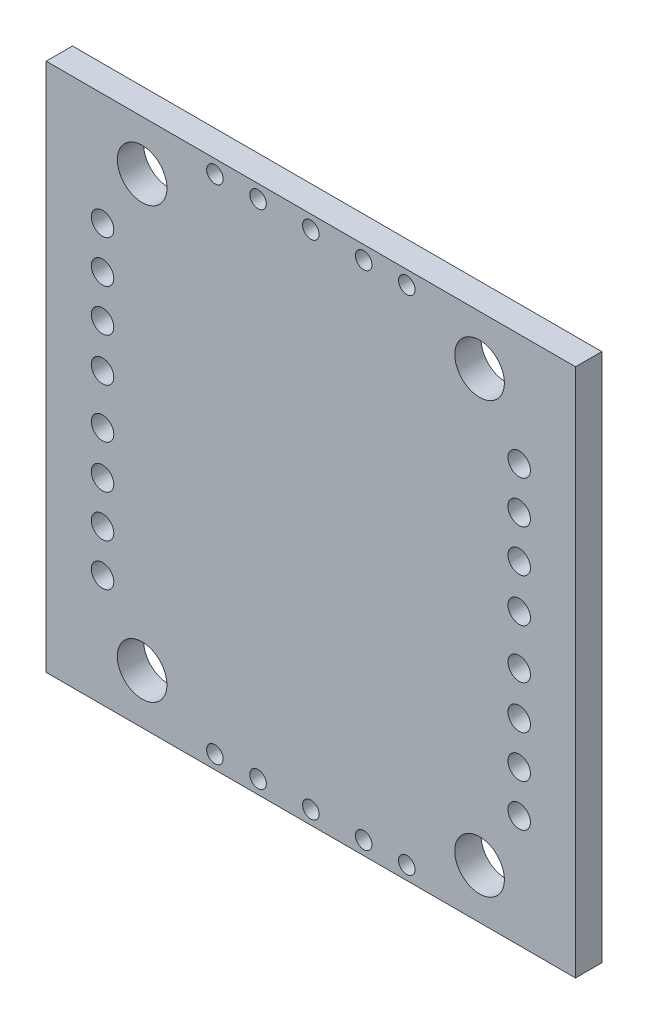
ISO-10303-21;
HEADER;
FILE_DESCRIPTION(('STEP AP214'),'2;1');
FILE_NAME('part.step','',(''),(''),'','','');
FILE_SCHEMA(('AUTOMOTIVE_DESIGN { 1 0 10303 214 1 1 1 1 }'));
ENDSEC;
DATA;
#1=APPLICATION_CONTEXT('core data for automotive mechanical design processes');
#2=APPLICATION_PROTOCOL_DEFINITION('international standard','automotive_design',2000,#1);
#3=PRODUCT_CONTEXT('',#1,'mechanical');
#4=PRODUCT('Part','Part','',(#3));
#5=PRODUCT_RELATED_PRODUCT_CATEGORY('part','',(#4));
#6=PRODUCT_DEFINITION_FORMATION('','',#4);
#7=PRODUCT_DEFINITION_CONTEXT('part definition',#1,'design');
#8=PRODUCT_DEFINITION('design','',#6,#7);
#9=PRODUCT_DEFINITION_SHAPE('','',#8);
#10=(LENGTH_UNIT() NAMED_UNIT(*) SI_UNIT(.MILLI.,.METRE.));
#11=(NAMED_UNIT(*) PLANE_ANGLE_UNIT() SI_UNIT($,.RADIAN.));
#12=(NAMED_UNIT(*) SI_UNIT($,.STERADIAN.) SOLID_ANGLE_UNIT());
#13=UNCERTAINTY_MEASURE_WITH_UNIT(LENGTH_MEASURE(1.E-05),#10,'distance_accuracy_value','');
#14=(GEOMETRIC_REPRESENTATION_CONTEXT(3) GLOBAL_UNCERTAINTY_ASSIGNED_CONTEXT((#13)) GLOBAL_UNIT_ASSIGNED_CONTEXT((#10,
#11,#12)) REPRESENTATION_CONTEXT('',''));
#15=CARTESIAN_POINT('',(0.,0.,0.));
#16=DIRECTION('',(0.,0.,1.));
#17=DIRECTION('',(1.,0.,0.));
#18=AXIS2_PLACEMENT_3D('',#15,#16,#17);
#19=CARTESIAN_POINT('',(0.,0.,1.59));
#20=DIRECTION('',(0.,0.,1.));
#21=DIRECTION('',(1.,0.,0.));
#22=AXIS2_PLACEMENT_3D('',#19,#20,#21);
#23=PLANE('',#22);
#24=CARTESIAN_POINT('',(-3.19388625109569,-15.18,1.59));
#25=DIRECTION('',(0.,0.,1.));
#26=DIRECTION('',(-1.,0.,0.));
#27=AXIS2_PLACEMENT_3D('',#24,#25,#26);
#28=CIRCLE('',#27,0.5);
#29=CARTESIAN_POINT('',(-3.69388625109569,-15.18,1.59));
#30=VERTEX_POINT('',#29);
#31=EDGE_CURVE('E280',#30,#30,#28,.T.);
#32=ORIENTED_EDGE('',*,*,#31,.F.);
#33=EDGE_LOOP('',(#32));
#34=FACE_BOUND('',#33,.T.);
#35=CARTESIAN_POINT('',(3.19388625109569,-15.18,1.59));
#36=DIRECTION('',(0.,0.,1.));
#37=DIRECTION('',(1.,0.,0.));
#38=AXIS2_PLACEMENT_3D('',#35,#36,#37);
#39=CIRCLE('',#38,0.5);
#40=CARTESIAN_POINT('',(3.69388625109569,-15.18,1.59));
#41=VERTEX_POINT('',#40);
#42=EDGE_CURVE('E268',#41,#41,#39,.T.);
#43=ORIENTED_EDGE('',*,*,#42,.F.);
#44=EDGE_LOOP('',(#43));
#45=FACE_BOUND('',#44,.T.);
#46=CARTESIAN_POINT('',(5.8,15.18,1.59));
#47=DIRECTION('',(0.,0.,1.));
#48=DIRECTION('',(-1.,0.,0.));
#49=AXIS2_PLACEMENT_3D('',#46,#47,#48);
#50=CIRCLE('',#49,0.500000000000001);
#51=CARTESIAN_POINT('',(5.3,15.18,1.59));
#52=VERTEX_POINT('',#51);
#53=EDGE_CURVE('E256',#52,#52,#50,.T.);
#54=ORIENTED_EDGE('',*,*,#53,.F.);
#55=EDGE_LOOP('',(#54));
#56=FACE_BOUND('',#55,.T.);
#57=CARTESIAN_POINT('',(-5.8,15.18,1.59));
#58=DIRECTION('',(0.,0.,1.));
#59=DIRECTION('',(1.,0.,0.));
#60=AXIS2_PLACEMENT_3D('',#57,#58,#59);
#61=CIRCLE('',#60,0.500000000000001);
#62=CARTESIAN_POINT('',(-5.3,15.18,1.59));
#63=VERTEX_POINT('',#62);
#64=EDGE_CURVE('E244',#63,#63,#61,.T.);
#65=ORIENTED_EDGE('',*,*,#64,.F.);
#66=EDGE_LOOP('',(#65));
#67=FACE_BOUND('',#66,.T.);
#68=CARTESIAN_POINT('',(12.5941332855159,6.66406810118192,1.59));
#69=DIRECTION('',(0.,0.,1.));
#70=DIRECTION('',(-1.,0.,0.));
#71=AXIS2_PLACEMENT_3D('',#68,#69,#70);
#72=CIRCLE('',#71,0.679999999999999);
#73=CARTESIAN_POINT('',(11.9141332855159,6.66406810118192,1.59));
#74=VERTEX_POINT('',#73);
#75=EDGE_CURVE('E232',#74,#74,#72,.T.);
#76=ORIENTED_EDGE('',*,*,#75,.F.);
#77=EDGE_LOOP('',(#76));
#78=FACE_BOUND('',#77,.T.);
#79=CARTESIAN_POINT('',(12.5941332855159,1.49230670087239,1.59));
#80=DIRECTION('',(0.,0.,1.));
#81=DIRECTION('',(-1.,0.,0.));
#82=AXIS2_PLACEMENT_3D('',#79,#80,#81);
#83=CIRCLE('',#82,0.679999999999999);
#84=CARTESIAN_POINT('',(11.9141332855159,1.49230670087239,1.59));
#85=VERTEX_POINT('',#84);
#86=EDGE_CURVE('E220',#85,#85,#83,.T.);
#87=ORIENTED_EDGE('',*,*,#86,.F.);
#88=EDGE_LOOP('',(#87));
#89=FACE_BOUND('',#88,.T.);
#90=CARTESIAN_POINT('',(12.5941332855159,-4.11092006811772,1.59));
#91=DIRECTION('',(0.,0.,1.));
#92=DIRECTION('',(1.,0.,0.));
#93=AXIS2_PLACEMENT_3D('',#90,#91,#92);
#94=CIRCLE('',#93,0.679999999999999);
#95=CARTESIAN_POINT('',(13.2741332855159,-4.11092006811772,1.59));
#96=VERTEX_POINT('',#95);
#97=EDGE_CURVE('E208',#96,#96,#94,.T.);
#98=ORIENTED_EDGE('',*,*,#97,.F.);
#99=EDGE_LOOP('',(#98));
#100=FACE_BOUND('',#99,.T.);
#101=CARTESIAN_POINT('',(12.5941332855159,-9.21721613424612,1.59));
#102=DIRECTION('',(0.,0.,1.));
#103=DIRECTION('',(1.,0.,0.));
#104=AXIS2_PLACEMENT_3D('',#101,#102,#103);
#105=CIRCLE('',#104,0.679999999999999);
#106=CARTESIAN_POINT('',(13.2741332855159,-9.21721613424612,1.59));
#107=VERTEX_POINT('',#106);
#108=EDGE_CURVE('E196',#107,#107,#105,.T.);
#109=ORIENTED_EDGE('',*,*,#108,.F.);
#110=EDGE_LOOP('',(#109));
#111=FACE_BOUND('',#110,.T.);
#112=CARTESIAN_POINT('',(-12.5941332855159,-6.66406810118192,1.59));
#113=DIRECTION('',(0.,0.,1.));
#114=DIRECTION('',(-1.,0.,0.));
#115=AXIS2_PLACEMENT_3D('',#112,#113,#114);
#116=CIRCLE('',#115,0.679999999999999);
#117=CARTESIAN_POINT('',(-13.2741332855159,-6.66406810118192,1.59));
#118=VERTEX_POINT('',#117);
#119=EDGE_CURVE('E184',#118,#118,#116,.T.);
#120=ORIENTED_EDGE('',*,*,#119,.F.);
#121=EDGE_LOOP('',(#120));
#122=FACE_BOUND('',#121,.T.);
#123=CARTESIAN_POINT('',(-12.5941332855159,-1.49230670087239,1.59));
#124=DIRECTION('',(0.,0.,1.));
#125=DIRECTION('',(-1.,0.,0.));
#126=AXIS2_PLACEMENT_3D('',#123,#124,#125);
#127=CIRCLE('',#126,0.679999999999999);
#128=CARTESIAN_POINT('',(-13.2741332855159,-1.49230670087239,1.59));
#129=VERTEX_POINT('',#128);
#130=EDGE_CURVE('E172',#129,#129,#127,.T.);
#131=ORIENTED_EDGE('',*,*,#130,.F.);
#132=EDGE_LOOP('',(#131));
#133=FACE_BOUND('',#132,.T.);
#134=CARTESIAN_POINT('',(-12.5941332855159,4.11092006811772,1.59));
#135=DIRECTION('',(0.,0.,1.));
#136=DIRECTION('',(1.,0.,0.));
#137=AXIS2_PLACEMENT_3D('',#134,#135,#136);
#138=CIRCLE('',#137,0.679999999999999);
#139=CARTESIAN_POINT('',(-11.9141332855159,4.11092006811772,1.59));
#140=VERTEX_POINT('',#139);
#141=EDGE_CURVE('E160',#140,#140,#138,.T.);
#142=ORIENTED_EDGE('',*,*,#141,.F.);
#143=EDGE_LOOP('',(#142));
#144=FACE_BOUND('',#143,.T.);
#145=CARTESIAN_POINT('',(-12.5941332855159,9.21721613424612,1.59));
#146=DIRECTION('',(0.,0.,1.));
#147=DIRECTION('',(1.,0.,0.));
#148=AXIS2_PLACEMENT_3D('',#145,#146,#147);
#149=CIRCLE('',#148,0.679999999999999);
#150=CARTESIAN_POINT('',(-11.9141332855159,9.21721613424612,1.59));
#151=VERTEX_POINT('',#150);
#152=EDGE_CURVE('E148',#151,#151,#149,.T.);
#153=ORIENTED_EDGE('',*,*,#152,.F.);
#154=EDGE_LOOP('',(#153));
#155=FACE_BOUND('',#154,.T.);
#156=CARTESIAN_POINT('',(10.2,-13.,1.59));
#157=DIRECTION('',(0.,0.,1.));
#158=DIRECTION('',(1.,0.,0.));
#159=AXIS2_PLACEMENT_3D('',#156,#157,#158);
#160=CIRCLE('',#159,1.5);
#161=CARTESIAN_POINT('',(11.7,-13.,1.59));
#162=VERTEX_POINT('',#161);
#163=EDGE_CURVE('E136',#162,#162,#160,.T.);
#164=ORIENTED_EDGE('',*,*,#163,.F.);
#165=EDGE_LOOP('',(#164));
#166=FACE_BOUND('',#165,.T.);
#167=CARTESIAN_POINT('',(-3.19388625109569,15.18,1.59));
#168=DIRECTION('',(0.,0.,1.));
#169=DIRECTION('',(1.,0.,0.));
#170=AXIS2_PLACEMENT_3D('',#167,#168,#169);
#171=CIRCLE('',#170,0.5);
#172=CARTESIAN_POINT('',(-2.69388625109569,15.18,1.59));
#173=VERTEX_POINT('',#172);
#174=EDGE_CURVE('E124',#173,#173,#171,.T.);
#175=ORIENTED_EDGE('',*,*,#174,.F.);
#176=EDGE_LOOP('',(#175));
#177=FACE_BOUND('',#176,.T.);
#178=CARTESIAN_POINT('',(-10.2,13.,1.59));
#179=DIRECTION('',(0.,0.,1.));
#180=DIRECTION('',(1.,0.,0.));
#181=AXIS2_PLACEMENT_3D('',#178,#179,#180);
#182=CIRCLE('',#181,1.5);
#183=CARTESIAN_POINT('',(-8.7,13.,1.59));
#184=VERTEX_POINT('',#183);
#185=EDGE_CURVE('E103',#184,#184,#182,.T.);
#186=ORIENTED_EDGE('',*,*,#185,.F.);
#187=EDGE_LOOP('',(#186));
#188=FACE_BOUND('',#187,.T.);
#189=DIRECTION('',(0.,-1.,0.));
#190=VECTOR('',#189,1.);
#191=CARTESIAN_POINT('',(-16.,-16.,1.59));
#192=LINE('',#191,#190);
#193=CARTESIAN_POINT('',(-16.,16.,1.59));
#194=VERTEX_POINT('',#193);
#195=CARTESIAN_POINT('',(-16.,-16.,1.59));
#196=VERTEX_POINT('',#195);
#197=EDGE_CURVE('E88',#194,#196,#192,.T.);
#198=ORIENTED_EDGE('',*,*,#197,.T.);
#199=DIRECTION('',(1.,0.,0.));
#200=VECTOR('',#199,1.);
#201=CARTESIAN_POINT('',(16.,-16.,1.59));
#202=LINE('',#201,#200);
#203=CARTESIAN_POINT('',(16.,-16.,1.59));
#204=VERTEX_POINT('',#203);
#205=EDGE_CURVE('E83',#196,#204,#202,.T.);
#206=ORIENTED_EDGE('',*,*,#205,.T.);
#207=DIRECTION('',(0.,1.,0.));
#208=VECTOR('',#207,1.);
#209=CARTESIAN_POINT('',(16.,-16.,1.59));
#210=LINE('',#209,#208);
#211=CARTESIAN_POINT('',(16.,16.,1.59));
#212=VERTEX_POINT('',#211);
#213=EDGE_CURVE('E86',#204,#212,#210,.T.);
#214=ORIENTED_EDGE('',*,*,#213,.T.);
#215=DIRECTION('',(-1.,0.,0.));
#216=VECTOR('',#215,1.);
#217=CARTESIAN_POINT('',(16.,16.,1.59));
#218=LINE('',#217,#216);
#219=EDGE_CURVE('E53',#212,#194,#218,.T.);
#220=ORIENTED_EDGE('',*,*,#219,.T.);
#221=EDGE_LOOP('',(#198,#206,#214,#220));
#222=FACE_BOUND('',#221,.T.);
#223=CARTESIAN_POINT('',(0.,15.18,1.59));
#224=DIRECTION('',(0.,0.,1.));
#225=DIRECTION('',(1.,0.,0.));
#226=AXIS2_PLACEMENT_3D('',#223,#224,#225);
#227=CIRCLE('',#226,0.5);
#228=CARTESIAN_POINT('',(0.5,15.18,1.59));
#229=VERTEX_POINT('',#228);
#230=EDGE_CURVE('E118',#229,#229,#227,.T.);
#231=ORIENTED_EDGE('',*,*,#230,.F.);
#232=EDGE_LOOP('',(#231));
#233=FACE_BOUND('',#232,.T.);
#234=CARTESIAN_POINT('',(10.2,13.,1.59));
#235=DIRECTION('',(0.,0.,1.));
#236=DIRECTION('',(-1.,0.,0.));
#237=AXIS2_PLACEMENT_3D('',#234,#235,#236);
#238=CIRCLE('',#237,1.5);
#239=CARTESIAN_POINT('',(8.7,13.,1.59));
#240=VERTEX_POINT('',#239);
#241=EDGE_CURVE('E130',#240,#240,#238,.T.);
#242=ORIENTED_EDGE('',*,*,#241,.F.);
#243=EDGE_LOOP('',(#242));
#244=FACE_BOUND('',#243,.T.);
#245=CARTESIAN_POINT('',(-10.2,-13.,1.59));
#246=DIRECTION('',(0.,0.,1.));
#247=DIRECTION('',(-1.,0.,0.));
#248=AXIS2_PLACEMENT_3D('',#245,#246,#247);
#249=CIRCLE('',#248,1.5);
#250=CARTESIAN_POINT('',(-11.7,-13.,1.59));
#251=VERTEX_POINT('',#250);
#252=EDGE_CURVE('E142',#251,#251,#249,.T.);
#253=ORIENTED_EDGE('',*,*,#252,.F.);
#254=EDGE_LOOP('',(#253));
#255=FACE_BOUND('',#254,.T.);
#256=CARTESIAN_POINT('',(-12.5941332855159,6.66406810118192,1.59));
#257=DIRECTION('',(0.,0.,1.));
#258=DIRECTION('',(1.,0.,0.));
#259=AXIS2_PLACEMENT_3D('',#256,#257,#258);
#260=CIRCLE('',#259,0.679999999999999);
#261=CARTESIAN_POINT('',(-11.9141332855159,6.66406810118192,1.59));
#262=VERTEX_POINT('',#261);
#263=EDGE_CURVE('E154',#262,#262,#260,.T.);
#264=ORIENTED_EDGE('',*,*,#263,.F.);
#265=EDGE_LOOP('',(#264));
#266=FACE_BOUND('',#265,.T.);
#267=CARTESIAN_POINT('',(-12.5941332855159,1.49230670087239,1.59));
#268=DIRECTION('',(0.,0.,1.));
#269=DIRECTION('',(1.,0.,0.));
#270=AXIS2_PLACEMENT_3D('',#267,#268,#269);
#271=CIRCLE('',#270,0.679999999999999);
#272=CARTESIAN_POINT('',(-11.9141332855159,1.49230670087239,1.59));
#273=VERTEX_POINT('',#272);
#274=EDGE_CURVE('E166',#273,#273,#271,.T.);
#275=ORIENTED_EDGE('',*,*,#274,.F.);
#276=EDGE_LOOP('',(#275));
#277=FACE_BOUND('',#276,.T.);
#278=CARTESIAN_POINT('',(-12.5941332855159,-4.11092006811772,1.59));
#279=DIRECTION('',(0.,0.,1.));
#280=DIRECTION('',(-1.,0.,0.));
#281=AXIS2_PLACEMENT_3D('',#278,#279,#280);
#282=CIRCLE('',#281,0.679999999999999);
#283=CARTESIAN_POINT('',(-13.2741332855159,-4.11092006811772,1.59));
#284=VERTEX_POINT('',#283);
#285=EDGE_CURVE('E178',#284,#284,#282,.T.);
#286=ORIENTED_EDGE('',*,*,#285,.F.);
#287=EDGE_LOOP('',(#286));
#288=FACE_BOUND('',#287,.T.);
#289=CARTESIAN_POINT('',(-12.5941332855159,-9.21721613424612,1.59));
#290=DIRECTION('',(0.,0.,1.));
#291=DIRECTION('',(-1.,0.,0.));
#292=AXIS2_PLACEMENT_3D('',#289,#290,#291);
#293=CIRCLE('',#292,0.679999999999999);
#294=CARTESIAN_POINT('',(-13.2741332855159,-9.21721613424612,1.59));
#295=VERTEX_POINT('',#294);
#296=EDGE_CURVE('E190',#295,#295,#293,.T.);
#297=ORIENTED_EDGE('',*,*,#296,.F.);
#298=EDGE_LOOP('',(#297));
#299=FACE_BOUND('',#298,.T.);
#300=CARTESIAN_POINT('',(12.5941332855159,-6.66406810118192,1.59));
#301=DIRECTION('',(0.,0.,1.));
#302=DIRECTION('',(1.,0.,0.));
#303=AXIS2_PLACEMENT_3D('',#300,#301,#302);
#304=CIRCLE('',#303,0.679999999999999);
#305=CARTESIAN_POINT('',(13.2741332855159,-6.66406810118192,1.59));
#306=VERTEX_POINT('',#305);
#307=EDGE_CURVE('E202',#306,#306,#304,.T.);
#308=ORIENTED_EDGE('',*,*,#307,.F.);
#309=EDGE_LOOP('',(#308));
#310=FACE_BOUND('',#309,.T.);
#311=CARTESIAN_POINT('',(12.5941332855159,-1.49230670087239,1.59));
#312=DIRECTION('',(0.,0.,1.));
#313=DIRECTION('',(1.,0.,0.));
#314=AXIS2_PLACEMENT_3D('',#311,#312,#313);
#315=CIRCLE('',#314,0.679999999999999);
#316=CARTESIAN_POINT('',(13.2741332855159,-1.49230670087239,1.59));
#317=VERTEX_POINT('',#316);
#318=EDGE_CURVE('E214',#317,#317,#315,.T.);
#319=ORIENTED_EDGE('',*,*,#318,.F.);
#320=EDGE_LOOP('',(#319));
#321=FACE_BOUND('',#320,.T.);
#322=CARTESIAN_POINT('',(12.5941332855159,4.11092006811772,1.59));
#323=DIRECTION('',(0.,0.,1.));
#324=DIRECTION('',(-1.,0.,0.));
#325=AXIS2_PLACEMENT_3D('',#322,#323,#324);
#326=CIRCLE('',#325,0.679999999999999);
#327=CARTESIAN_POINT('',(11.9141332855159,4.11092006811772,1.59));
#328=VERTEX_POINT('',#327);
#329=EDGE_CURVE('E226',#328,#328,#326,.T.);
#330=ORIENTED_EDGE('',*,*,#329,.F.);
#331=EDGE_LOOP('',(#330));
#332=FACE_BOUND('',#331,.T.);
#333=CARTESIAN_POINT('',(12.5941332855159,9.21721613424612,1.59));
#334=DIRECTION('',(0.,0.,1.));
#335=DIRECTION('',(-1.,0.,0.));
#336=AXIS2_PLACEMENT_3D('',#333,#334,#335);
#337=CIRCLE('',#336,0.679999999999999);
#338=CARTESIAN_POINT('',(11.9141332855159,9.21721613424612,1.59));
#339=VERTEX_POINT('',#338);
#340=EDGE_CURVE('E238',#339,#339,#337,.T.);
#341=ORIENTED_EDGE('',*,*,#340,.F.);
#342=EDGE_LOOP('',(#341));
#343=FACE_BOUND('',#342,.T.);
#344=CARTESIAN_POINT('',(3.19388625109569,15.18,1.59));
#345=DIRECTION('',(0.,0.,1.));
#346=DIRECTION('',(-1.,0.,0.));
#347=AXIS2_PLACEMENT_3D('',#344,#345,#346);
#348=CIRCLE('',#347,0.5);
#349=CARTESIAN_POINT('',(2.69388625109569,15.18,1.59));
#350=VERTEX_POINT('',#349);
#351=EDGE_CURVE('E250',#350,#350,#348,.T.);
#352=ORIENTED_EDGE('',*,*,#351,.F.);
#353=EDGE_LOOP('',(#352));
#354=FACE_BOUND('',#353,.T.);
#355=CARTESIAN_POINT('',(5.8,-15.18,1.59));
#356=DIRECTION('',(0.,0.,1.));
#357=DIRECTION('',(1.,0.,0.));
#358=AXIS2_PLACEMENT_3D('',#355,#356,#357);
#359=CIRCLE('',#358,0.500000000000001);
#360=CARTESIAN_POINT('',(6.3,-15.18,1.59));
#361=VERTEX_POINT('',#360);
#362=EDGE_CURVE('E262',#361,#361,#359,.T.);
#363=ORIENTED_EDGE('',*,*,#362,.F.);
#364=EDGE_LOOP('',(#363));
#365=FACE_BOUND('',#364,.T.);
#366=CARTESIAN_POINT('',(0.,-15.18,1.59));
#367=DIRECTION('',(0.,0.,1.));
#368=DIRECTION('',(-1.,0.,0.));
#369=AXIS2_PLACEMENT_3D('',#366,#367,#368);
#370=CIRCLE('',#369,0.5);
#371=CARTESIAN_POINT('',(-0.5,-15.18,1.59));
#372=VERTEX_POINT('',#371);
#373=EDGE_CURVE('E274',#372,#372,#370,.T.);
#374=ORIENTED_EDGE('',*,*,#373,.F.);
#375=EDGE_LOOP('',(#374));
#376=FACE_BOUND('',#375,.T.);
#377=CARTESIAN_POINT('',(-5.8,-15.18,1.59));
#378=DIRECTION('',(0.,0.,1.));
#379=DIRECTION('',(-1.,0.,0.));
#380=AXIS2_PLACEMENT_3D('',#377,#378,#379);
#381=CIRCLE('',#380,0.500000000000001);
#382=CARTESIAN_POINT('',(-6.3,-15.18,1.59));
#383=VERTEX_POINT('',#382);
#384=EDGE_CURVE('E286',#383,#383,#381,.T.);
#385=ORIENTED_EDGE('',*,*,#384,.F.);
#386=EDGE_LOOP('',(#385));
#387=FACE_BOUND('',#386,.T.);
#388=ADVANCED_FACE('F36',(#34,#45,#56,#67,#78,#89,#100,#111,#122,#133,#144,#155,#166,#177,#188,
#222,#233,#244,#255,#266,#277,#288,#299,#310,#321,#332,#343,#354,#365,#376,#387),#23,.T.);
#389=CARTESIAN_POINT('',(0.,0.,0.));
#390=DIRECTION('',(0.,0.,1.));
#391=DIRECTION('',(1.,0.,0.));
#392=AXIS2_PLACEMENT_3D('',#389,#390,#391);
#393=PLANE('',#392);
#394=DIRECTION('',(0.,-1.,0.));
#395=VECTOR('',#394,1.);
#396=CARTESIAN_POINT('',(-16.,-16.,0.));
#397=LINE('',#396,#395);
#398=CARTESIAN_POINT('',(-16.,16.,0.));
#399=VERTEX_POINT('',#398);
#400=CARTESIAN_POINT('',(-16.,-16.,0.));
#401=VERTEX_POINT('',#400);
#402=EDGE_CURVE('E100',#399,#401,#397,.T.);
#403=ORIENTED_EDGE('',*,*,#402,.F.);
#404=DIRECTION('',(-1.,0.,0.));
#405=VECTOR('',#404,1.);
#406=CARTESIAN_POINT('',(16.,16.,0.));
#407=LINE('',#406,#405);
#408=CARTESIAN_POINT('',(16.,16.,0.));
#409=VERTEX_POINT('',#408);
#410=EDGE_CURVE('E76',#409,#399,#407,.T.);
#411=ORIENTED_EDGE('',*,*,#410,.F.);
#412=DIRECTION('',(0.,1.,0.));
#413=VECTOR('',#412,1.);
#414=CARTESIAN_POINT('',(16.,-16.,0.));
#415=LINE('',#414,#413);
#416=CARTESIAN_POINT('',(16.,-16.,0.));
#417=VERTEX_POINT('',#416);
#418=EDGE_CURVE('E70',#417,#409,#415,.T.);
#419=ORIENTED_EDGE('',*,*,#418,.F.);
#420=DIRECTION('',(1.,0.,0.));
#421=VECTOR('',#420,1.);
#422=CARTESIAN_POINT('',(16.,-16.,0.));
#423=LINE('',#422,#421);
#424=EDGE_CURVE('E92',#401,#417,#423,.T.);
#425=ORIENTED_EDGE('',*,*,#424,.F.);
#426=EDGE_LOOP('',(#403,#411,#419,#425));
#427=FACE_BOUND('',#426,.T.);
#428=CARTESIAN_POINT('',(-10.2,13.,0.));
#429=DIRECTION('',(0.,0.,1.));
#430=DIRECTION('',(1.,0.,0.));
#431=AXIS2_PLACEMENT_3D('',#428,#429,#430);
#432=CIRCLE('',#431,1.5);
#433=CARTESIAN_POINT('',(-8.7,13.,0.));
#434=VERTEX_POINT('',#433);
#435=EDGE_CURVE('E115',#434,#434,#432,.T.);
#436=ORIENTED_EDGE('',*,*,#435,.T.);
#437=EDGE_LOOP('',(#436));
#438=FACE_BOUND('',#437,.T.);
#439=CARTESIAN_POINT('',(0.,15.18,0.));
#440=DIRECTION('',(0.,0.,1.));
#441=DIRECTION('',(1.,0.,0.));
#442=AXIS2_PLACEMENT_3D('',#439,#440,#441);
#443=CIRCLE('',#442,0.5);
#444=CARTESIAN_POINT('',(0.5,15.18,0.));
#445=VERTEX_POINT('',#444);
#446=EDGE_CURVE('E121',#445,#445,#443,.T.);
#447=ORIENTED_EDGE('',*,*,#446,.T.);
#448=EDGE_LOOP('',(#447));
#449=FACE_BOUND('',#448,.T.);
#450=CARTESIAN_POINT('',(-3.19388625109569,15.18,0.));
#451=DIRECTION('',(0.,0.,1.));
#452=DIRECTION('',(1.,0.,0.));
#453=AXIS2_PLACEMENT_3D('',#450,#451,#452);
#454=CIRCLE('',#453,0.5);
#455=CARTESIAN_POINT('',(-2.69388625109569,15.18,0.));
#456=VERTEX_POINT('',#455);
#457=EDGE_CURVE('E127',#456,#456,#454,.T.);
#458=ORIENTED_EDGE('',*,*,#457,.T.);
#459=EDGE_LOOP('',(#458));
#460=FACE_BOUND('',#459,.T.);
#461=CARTESIAN_POINT('',(10.2,13.,0.));
#462=DIRECTION('',(0.,0.,1.));
#463=DIRECTION('',(-1.,0.,0.));
#464=AXIS2_PLACEMENT_3D('',#461,#462,#463);
#465=CIRCLE('',#464,1.5);
#466=CARTESIAN_POINT('',(8.7,13.,0.));
#467=VERTEX_POINT('',#466);
#468=EDGE_CURVE('E133',#467,#467,#465,.T.);
#469=ORIENTED_EDGE('',*,*,#468,.T.);
#470=EDGE_LOOP('',(#469));
#471=FACE_BOUND('',#470,.T.);
#472=CARTESIAN_POINT('',(10.2,-13.,0.));
#473=DIRECTION('',(0.,0.,1.));
#474=DIRECTION('',(1.,0.,0.));
#475=AXIS2_PLACEMENT_3D('',#472,#473,#474);
#476=CIRCLE('',#475,1.5);
#477=CARTESIAN_POINT('',(11.7,-13.,0.));
#478=VERTEX_POINT('',#477);
#479=EDGE_CURVE('E139',#478,#478,#476,.T.);
#480=ORIENTED_EDGE('',*,*,#479,.T.);
#481=EDGE_LOOP('',(#480));
#482=FACE_BOUND('',#481,.T.);
#483=CARTESIAN_POINT('',(-10.2,-13.,0.));
#484=DIRECTION('',(0.,0.,1.));
#485=DIRECTION('',(-1.,0.,0.));
#486=AXIS2_PLACEMENT_3D('',#483,#484,#485);
#487=CIRCLE('',#486,1.5);
#488=CARTESIAN_POINT('',(-11.7,-13.,0.));
#489=VERTEX_POINT('',#488);
#490=EDGE_CURVE('E145',#489,#489,#487,.T.);
#491=ORIENTED_EDGE('',*,*,#490,.T.);
#492=EDGE_LOOP('',(#491));
#493=FACE_BOUND('',#492,.T.);
#494=CARTESIAN_POINT('',(-12.5941332855159,9.21721613424612,0.));
#495=DIRECTION('',(0.,0.,1.));
#496=DIRECTION('',(1.,0.,0.));
#497=AXIS2_PLACEMENT_3D('',#494,#495,#496);
#498=CIRCLE('',#497,0.679999999999999);
#499=CARTESIAN_POINT('',(-11.9141332855159,9.21721613424612,0.));
#500=VERTEX_POINT('',#499);
#501=EDGE_CURVE('E151',#500,#500,#498,.T.);
#502=ORIENTED_EDGE('',*,*,#501,.T.);
#503=EDGE_LOOP('',(#502));
#504=FACE_BOUND('',#503,.T.);
#505=CARTESIAN_POINT('',(-12.5941332855159,6.66406810118192,0.));
#506=DIRECTION('',(0.,0.,1.));
#507=DIRECTION('',(1.,0.,0.));
#508=AXIS2_PLACEMENT_3D('',#505,#506,#507);
#509=CIRCLE('',#508,0.679999999999999);
#510=CARTESIAN_POINT('',(-11.9141332855159,6.66406810118192,0.));
#511=VERTEX_POINT('',#510);
#512=EDGE_CURVE('E157',#511,#511,#509,.T.);
#513=ORIENTED_EDGE('',*,*,#512,.T.);
#514=EDGE_LOOP('',(#513));
#515=FACE_BOUND('',#514,.T.);
#516=CARTESIAN_POINT('',(-12.5941332855159,4.11092006811772,0.));
#517=DIRECTION('',(0.,0.,1.));
#518=DIRECTION('',(1.,0.,0.));
#519=AXIS2_PLACEMENT_3D('',#516,#517,#518);
#520=CIRCLE('',#519,0.679999999999999);
#521=CARTESIAN_POINT('',(-11.9141332855159,4.11092006811772,0.));
#522=VERTEX_POINT('',#521);
#523=EDGE_CURVE('E163',#522,#522,#520,.T.);
#524=ORIENTED_EDGE('',*,*,#523,.T.);
#525=EDGE_LOOP('',(#524));
#526=FACE_BOUND('',#525,.T.);
#527=CARTESIAN_POINT('',(-12.5941332855159,1.49230670087239,0.));
#528=DIRECTION('',(0.,0.,1.));
#529=DIRECTION('',(1.,0.,0.));
#530=AXIS2_PLACEMENT_3D('',#527,#528,#529);
#531=CIRCLE('',#530,0.679999999999999);
#532=CARTESIAN_POINT('',(-11.9141332855159,1.49230670087239,0.));
#533=VERTEX_POINT('',#532);
#534=EDGE_CURVE('E169',#533,#533,#531,.T.);
#535=ORIENTED_EDGE('',*,*,#534,.T.);
#536=EDGE_LOOP('',(#535));
#537=FACE_BOUND('',#536,.T.);
#538=CARTESIAN_POINT('',(-12.5941332855159,-1.49230670087239,0.));
#539=DIRECTION('',(0.,0.,1.));
#540=DIRECTION('',(-1.,0.,0.));
#541=AXIS2_PLACEMENT_3D('',#538,#539,#540);
#542=CIRCLE('',#541,0.679999999999999);
#543=CARTESIAN_POINT('',(-13.2741332855159,-1.49230670087239,0.));
#544=VERTEX_POINT('',#543);
#545=EDGE_CURVE('E175',#544,#544,#542,.T.);
#546=ORIENTED_EDGE('',*,*,#545,.T.);
#547=EDGE_LOOP('',(#546));
#548=FACE_BOUND('',#547,.T.);
#549=CARTESIAN_POINT('',(-12.5941332855159,-4.11092006811772,0.));
#550=DIRECTION('',(0.,0.,1.));
#551=DIRECTION('',(-1.,0.,0.));
#552=AXIS2_PLACEMENT_3D('',#549,#550,#551);
#553=CIRCLE('',#552,0.679999999999999);
#554=CARTESIAN_POINT('',(-13.2741332855159,-4.11092006811772,0.));
#555=VERTEX_POINT('',#554);
#556=EDGE_CURVE('E181',#555,#555,#553,.T.);
#557=ORIENTED_EDGE('',*,*,#556,.T.);
#558=EDGE_LOOP('',(#557));
#559=FACE_BOUND('',#558,.T.);
#560=CARTESIAN_POINT('',(-12.5941332855159,-6.66406810118192,0.));
#561=DIRECTION('',(0.,0.,1.));
#562=DIRECTION('',(-1.,0.,0.));
#563=AXIS2_PLACEMENT_3D('',#560,#561,#562);
#564=CIRCLE('',#563,0.679999999999999);
#565=CARTESIAN_POINT('',(-13.2741332855159,-6.66406810118192,0.));
#566=VERTEX_POINT('',#565);
#567=EDGE_CURVE('E187',#566,#566,#564,.T.);
#568=ORIENTED_EDGE('',*,*,#567,.T.);
#569=EDGE_LOOP('',(#568));
#570=FACE_BOUND('',#569,.T.);
#571=CARTESIAN_POINT('',(-12.5941332855159,-9.21721613424612,0.));
#572=DIRECTION('',(0.,0.,1.));
#573=DIRECTION('',(-1.,0.,0.));
#574=AXIS2_PLACEMENT_3D('',#571,#572,#573);
#575=CIRCLE('',#574,0.679999999999999);
#576=CARTESIAN_POINT('',(-13.2741332855159,-9.21721613424612,0.));
#577=VERTEX_POINT('',#576);
#578=EDGE_CURVE('E193',#577,#577,#575,.T.);
#579=ORIENTED_EDGE('',*,*,#578,.T.);
#580=EDGE_LOOP('',(#579));
#581=FACE_BOUND('',#580,.T.);
#582=CARTESIAN_POINT('',(12.5941332855159,-9.21721613424612,0.));
#583=DIRECTION('',(0.,0.,1.));
#584=DIRECTION('',(1.,0.,0.));
#585=AXIS2_PLACEMENT_3D('',#582,#583,#584);
#586=CIRCLE('',#585,0.679999999999999);
#587=CARTESIAN_POINT('',(13.2741332855159,-9.21721613424612,0.));
#588=VERTEX_POINT('',#587);
#589=EDGE_CURVE('E199',#588,#588,#586,.T.);
#590=ORIENTED_EDGE('',*,*,#589,.T.);
#591=EDGE_LOOP('',(#590));
#592=FACE_BOUND('',#591,.T.);
#593=CARTESIAN_POINT('',(12.5941332855159,-6.66406810118192,0.));
#594=DIRECTION('',(0.,0.,1.));
#595=DIRECTION('',(1.,0.,0.));
#596=AXIS2_PLACEMENT_3D('',#593,#594,#595);
#597=CIRCLE('',#596,0.679999999999999);
#598=CARTESIAN_POINT('',(13.2741332855159,-6.66406810118192,0.));
#599=VERTEX_POINT('',#598);
#600=EDGE_CURVE('E205',#599,#599,#597,.T.);
#601=ORIENTED_EDGE('',*,*,#600,.T.);
#602=EDGE_LOOP('',(#601));
#603=FACE_BOUND('',#602,.T.);
#604=CARTESIAN_POINT('',(12.5941332855159,-4.11092006811772,0.));
#605=DIRECTION('',(0.,0.,1.));
#606=DIRECTION('',(1.,0.,0.));
#607=AXIS2_PLACEMENT_3D('',#604,#605,#606);
#608=CIRCLE('',#607,0.679999999999999);
#609=CARTESIAN_POINT('',(13.2741332855159,-4.11092006811772,0.));
#610=VERTEX_POINT('',#609);
#611=EDGE_CURVE('E211',#610,#610,#608,.T.);
#612=ORIENTED_EDGE('',*,*,#611,.T.);
#613=EDGE_LOOP('',(#612));
#614=FACE_BOUND('',#613,.T.);
#615=CARTESIAN_POINT('',(12.5941332855159,-1.49230670087239,0.));
#616=DIRECTION('',(0.,0.,1.));
#617=DIRECTION('',(1.,0.,0.));
#618=AXIS2_PLACEMENT_3D('',#615,#616,#617);
#619=CIRCLE('',#618,0.679999999999999);
#620=CARTESIAN_POINT('',(13.2741332855159,-1.49230670087239,0.));
#621=VERTEX_POINT('',#620);
#622=EDGE_CURVE('E217',#621,#621,#619,.T.);
#623=ORIENTED_EDGE('',*,*,#622,.T.);
#624=EDGE_LOOP('',(#623));
#625=FACE_BOUND('',#624,.T.);
#626=CARTESIAN_POINT('',(12.5941332855159,1.49230670087239,0.));
#627=DIRECTION('',(0.,0.,1.));
#628=DIRECTION('',(-1.,0.,0.));
#629=AXIS2_PLACEMENT_3D('',#626,#627,#628);
#630=CIRCLE('',#629,0.679999999999999);
#631=CARTESIAN_POINT('',(11.9141332855159,1.49230670087239,0.));
#632=VERTEX_POINT('',#631);
#633=EDGE_CURVE('E223',#632,#632,#630,.T.);
#634=ORIENTED_EDGE('',*,*,#633,.T.);
#635=EDGE_LOOP('',(#634));
#636=FACE_BOUND('',#635,.T.);
#637=CARTESIAN_POINT('',(12.5941332855159,4.11092006811772,0.));
#638=DIRECTION('',(0.,0.,1.));
#639=DIRECTION('',(-1.,0.,0.));
#640=AXIS2_PLACEMENT_3D('',#637,#638,#639);
#641=CIRCLE('',#640,0.679999999999999);
#642=CARTESIAN_POINT('',(11.9141332855159,4.11092006811772,0.));
#643=VERTEX_POINT('',#642);
#644=EDGE_CURVE('E229',#643,#643,#641,.T.);
#645=ORIENTED_EDGE('',*,*,#644,.T.);
#646=EDGE_LOOP('',(#645));
#647=FACE_BOUND('',#646,.T.);
#648=CARTESIAN_POINT('',(12.5941332855159,6.66406810118192,0.));
#649=DIRECTION('',(0.,0.,1.));
#650=DIRECTION('',(-1.,0.,0.));
#651=AXIS2_PLACEMENT_3D('',#648,#649,#650);
#652=CIRCLE('',#651,0.679999999999999);
#653=CARTESIAN_POINT('',(11.9141332855159,6.66406810118192,0.));
#654=VERTEX_POINT('',#653);
#655=EDGE_CURVE('E235',#654,#654,#652,.T.);
#656=ORIENTED_EDGE('',*,*,#655,.T.);
#657=EDGE_LOOP('',(#656));
#658=FACE_BOUND('',#657,.T.);
#659=CARTESIAN_POINT('',(12.5941332855159,9.21721613424612,0.));
#660=DIRECTION('',(0.,0.,1.));
#661=DIRECTION('',(-1.,0.,0.));
#662=AXIS2_PLACEMENT_3D('',#659,#660,#661);
#663=CIRCLE('',#662,0.679999999999999);
#664=CARTESIAN_POINT('',(11.9141332855159,9.21721613424612,0.));
#665=VERTEX_POINT('',#664);
#666=EDGE_CURVE('E241',#665,#665,#663,.T.);
#667=ORIENTED_EDGE('',*,*,#666,.T.);
#668=EDGE_LOOP('',(#667));
#669=FACE_BOUND('',#668,.T.);
#670=CARTESIAN_POINT('',(-5.8,15.18,0.));
#671=DIRECTION('',(0.,0.,1.));
#672=DIRECTION('',(1.,0.,0.));
#673=AXIS2_PLACEMENT_3D('',#670,#671,#672);
#674=CIRCLE('',#673,0.500000000000001);
#675=CARTESIAN_POINT('',(-5.3,15.18,0.));
#676=VERTEX_POINT('',#675);
#677=EDGE_CURVE('E247',#676,#676,#674,.T.);
#678=ORIENTED_EDGE('',*,*,#677,.T.);
#679=EDGE_LOOP('',(#678));
#680=FACE_BOUND('',#679,.T.);
#681=CARTESIAN_POINT('',(3.19388625109569,15.18,0.));
#682=DIRECTION('',(0.,0.,1.));
#683=DIRECTION('',(-1.,0.,0.));
#684=AXIS2_PLACEMENT_3D('',#681,#682,#683);
#685=CIRCLE('',#684,0.5);
#686=CARTESIAN_POINT('',(2.69388625109569,15.18,0.));
#687=VERTEX_POINT('',#686);
#688=EDGE_CURVE('E253',#687,#687,#685,.T.);
#689=ORIENTED_EDGE('',*,*,#688,.T.);
#690=EDGE_LOOP('',(#689));
#691=FACE_BOUND('',#690,.T.);
#692=CARTESIAN_POINT('',(5.8,15.18,0.));
#693=DIRECTION('',(0.,0.,1.));
#694=DIRECTION('',(-1.,0.,0.));
#695=AXIS2_PLACEMENT_3D('',#692,#693,#694);
#696=CIRCLE('',#695,0.500000000000001);
#697=CARTESIAN_POINT('',(5.3,15.18,0.));
#698=VERTEX_POINT('',#697);
#699=EDGE_CURVE('E259',#698,#698,#696,.T.);
#700=ORIENTED_EDGE('',*,*,#699,.T.);
#701=EDGE_LOOP('',(#700));
#702=FACE_BOUND('',#701,.T.);
#703=CARTESIAN_POINT('',(5.8,-15.18,0.));
#704=DIRECTION('',(0.,0.,1.));
#705=DIRECTION('',(1.,0.,0.));
#706=AXIS2_PLACEMENT_3D('',#703,#704,#705);
#707=CIRCLE('',#706,0.500000000000001);
#708=CARTESIAN_POINT('',(6.3,-15.18,0.));
#709=VERTEX_POINT('',#708);
#710=EDGE_CURVE('E265',#709,#709,#707,.T.);
#711=ORIENTED_EDGE('',*,*,#710,.T.);
#712=EDGE_LOOP('',(#711));
#713=FACE_BOUND('',#712,.T.);
#714=CARTESIAN_POINT('',(3.19388625109569,-15.18,0.));
#715=DIRECTION('',(0.,0.,1.));
#716=DIRECTION('',(1.,0.,0.));
#717=AXIS2_PLACEMENT_3D('',#714,#715,#716);
#718=CIRCLE('',#717,0.5);
#719=CARTESIAN_POINT('',(3.69388625109569,-15.18,0.));
#720=VERTEX_POINT('',#719);
#721=EDGE_CURVE('E271',#720,#720,#718,.T.);
#722=ORIENTED_EDGE('',*,*,#721,.T.);
#723=EDGE_LOOP('',(#722));
#724=FACE_BOUND('',#723,.T.);
#725=CARTESIAN_POINT('',(0.,-15.18,0.));
#726=DIRECTION('',(0.,0.,1.));
#727=DIRECTION('',(-1.,0.,0.));
#728=AXIS2_PLACEMENT_3D('',#725,#726,#727);
#729=CIRCLE('',#728,0.5);
#730=CARTESIAN_POINT('',(-0.5,-15.18,0.));
#731=VERTEX_POINT('',#730);
#732=EDGE_CURVE('E277',#731,#731,#729,.T.);
#733=ORIENTED_EDGE('',*,*,#732,.T.);
#734=EDGE_LOOP('',(#733));
#735=FACE_BOUND('',#734,.T.);
#736=CARTESIAN_POINT('',(-3.19388625109569,-15.18,0.));
#737=DIRECTION('',(0.,0.,1.));
#738=DIRECTION('',(-1.,0.,0.));
#739=AXIS2_PLACEMENT_3D('',#736,#737,#738);
#740=CIRCLE('',#739,0.5);
#741=CARTESIAN_POINT('',(-3.69388625109569,-15.18,0.));
#742=VERTEX_POINT('',#741);
#743=EDGE_CURVE('E283',#742,#742,#740,.T.);
#744=ORIENTED_EDGE('',*,*,#743,.T.);
#745=EDGE_LOOP('',(#744));
#746=FACE_BOUND('',#745,.T.);
#747=CARTESIAN_POINT('',(-5.8,-15.18,0.));
#748=DIRECTION('',(0.,0.,1.));
#749=DIRECTION('',(-1.,0.,0.));
#750=AXIS2_PLACEMENT_3D('',#747,#748,#749);
#751=CIRCLE('',#750,0.500000000000001);
#752=CARTESIAN_POINT('',(-6.3,-15.18,0.));
#753=VERTEX_POINT('',#752);
#754=EDGE_CURVE('E289',#753,#753,#751,.T.);
#755=ORIENTED_EDGE('',*,*,#754,.T.);
#756=EDGE_LOOP('',(#755));
#757=FACE_BOUND('',#756,.T.);
#758=ADVANCED_FACE('F111',(#427,#438,#449,#460,#471,#482,#493,#504,#515,#526,#537,#548,#559,
#570,#581,#592,#603,#614,#625,#636,#647,#658,#669,#680,#691,#702,#713,#724,#735,#746,#757),#393,.F.);
#759=CARTESIAN_POINT('',(-16.,-16.,1.59));
#760=DIRECTION('',(1.,0.,0.));
#761=DIRECTION('',(0.,0.,-1.));
#762=AXIS2_PLACEMENT_3D('',#759,#760,#761);
#763=PLANE('',#762);
#764=ORIENTED_EDGE('',*,*,#402,.T.);
#765=DIRECTION('',(0.,0.,-1.));
#766=VECTOR('',#765,1.);
#767=CARTESIAN_POINT('',(-16.,-16.,1.59));
#768=LINE('',#767,#766);
#769=EDGE_CURVE('E11',#196,#401,#768,.T.);
#770=ORIENTED_EDGE('',*,*,#769,.F.);
#771=ORIENTED_EDGE('',*,*,#197,.F.);
#772=DIRECTION('',(0.,0.,-1.));
#773=VECTOR('',#772,1.);
#774=CARTESIAN_POINT('',(-16.,16.,1.59));
#775=LINE('',#774,#773);
#776=EDGE_CURVE('E96',#194,#399,#775,.T.);
#777=ORIENTED_EDGE('',*,*,#776,.T.);
#778=EDGE_LOOP('',(#764,#770,#771,#777));
#779=FACE_BOUND('',#778,.T.);
#780=ADVANCED_FACE('F38',(#779),#763,.F.);
#781=CARTESIAN_POINT('',(16.,-16.,1.59));
#782=DIRECTION('',(0.,1.,0.));
#783=DIRECTION('',(-1.,0.,0.));
#784=AXIS2_PLACEMENT_3D('',#781,#782,#783);
#785=PLANE('',#784);
#786=ORIENTED_EDGE('',*,*,#424,.T.);
#787=DIRECTION('',(0.,0.,-1.));
#788=VECTOR('',#787,1.);
#789=CARTESIAN_POINT('',(16.,-16.,1.59));
#790=LINE('',#789,#788);
#791=EDGE_CURVE('E45',#204,#417,#790,.T.);
#792=ORIENTED_EDGE('',*,*,#791,.F.);
#793=ORIENTED_EDGE('',*,*,#205,.F.);
#794=ORIENTED_EDGE('',*,*,#769,.T.);
#795=EDGE_LOOP('',(#786,#792,#793,#794));
#796=FACE_BOUND('',#795,.T.);
#797=ADVANCED_FACE('F91',(#796),#785,.F.);
#798=CARTESIAN_POINT('',(16.,-16.,1.59));
#799=DIRECTION('',(-1.,0.,0.));
#800=DIRECTION('',(0.,0.,1.));
#801=AXIS2_PLACEMENT_3D('',#798,#799,#800);
#802=PLANE('',#801);
#803=ORIENTED_EDGE('',*,*,#418,.T.);
#804=DIRECTION('',(0.,0.,-1.));
#805=VECTOR('',#804,1.);
#806=CARTESIAN_POINT('',(16.,16.,1.59));
#807=LINE('',#806,#805);
#808=EDGE_CURVE('E93',#212,#409,#807,.T.);
#809=ORIENTED_EDGE('',*,*,#808,.F.);
#810=ORIENTED_EDGE('',*,*,#213,.F.);
#811=ORIENTED_EDGE('',*,*,#791,.T.);
#812=EDGE_LOOP('',(#803,#809,#810,#811));
#813=FACE_BOUND('',#812,.T.);
#814=ADVANCED_FACE('F94',(#813),#802,.F.);
#815=CARTESIAN_POINT('',(16.,16.,1.59));
#816=DIRECTION('',(0.,-1.,0.));
#817=DIRECTION('',(1.,0.,0.));
#818=AXIS2_PLACEMENT_3D('',#815,#816,#817);
#819=PLANE('',#818);
#820=ORIENTED_EDGE('',*,*,#410,.T.);
#821=ORIENTED_EDGE('',*,*,#776,.F.);
#822=ORIENTED_EDGE('',*,*,#219,.F.);
#823=ORIENTED_EDGE('',*,*,#808,.T.);
#824=EDGE_LOOP('',(#820,#821,#822,#823));
#825=FACE_BOUND('',#824,.T.);
#826=ADVANCED_FACE('F108',(#825),#819,.F.);
#827=CARTESIAN_POINT('',(-10.2,13.,1.59));
#828=DIRECTION('',(0.,0.,-1.));
#829=DIRECTION('',(-1.,0.,0.));
#830=AXIS2_PLACEMENT_3D('',#827,#828,#829);
#831=CYLINDRICAL_SURFACE('',#830,1.5);
#832=ORIENTED_EDGE('',*,*,#185,.T.);
#833=EDGE_LOOP('',(#832));
#834=FACE_BOUND('',#833,.T.);
#835=ORIENTED_EDGE('',*,*,#435,.F.);
#836=EDGE_LOOP('',(#835));
#837=FACE_BOUND('',#836,.T.);
#838=ADVANCED_FACE('F308',(#834,#837),#831,.F.);
#839=CARTESIAN_POINT('',(0.,15.18,1.59));
#840=DIRECTION('',(0.,0.,-1.));
#841=DIRECTION('',(-1.,0.,0.));
#842=AXIS2_PLACEMENT_3D('',#839,#840,#841);
#843=CYLINDRICAL_SURFACE('',#842,0.5);
#844=ORIENTED_EDGE('',*,*,#230,.T.);
#845=EDGE_LOOP('',(#844));
#846=FACE_BOUND('',#845,.T.);
#847=ORIENTED_EDGE('',*,*,#446,.F.);
#848=EDGE_LOOP('',(#847));
#849=FACE_BOUND('',#848,.T.);
#850=ADVANCED_FACE('F356',(#846,#849),#843,.F.);
#851=CARTESIAN_POINT('',(-3.19388625109569,15.18,1.59));
#852=DIRECTION('',(0.,0.,-1.));
#853=DIRECTION('',(-1.,0.,0.));
#854=AXIS2_PLACEMENT_3D('',#851,#852,#853);
#855=CYLINDRICAL_SURFACE('',#854,0.5);
#856=ORIENTED_EDGE('',*,*,#174,.T.);
#857=EDGE_LOOP('',(#856));
#858=FACE_BOUND('',#857,.T.);
#859=ORIENTED_EDGE('',*,*,#457,.F.);
#860=EDGE_LOOP('',(#859));
#861=FACE_BOUND('',#860,.T.);
#862=ADVANCED_FACE('F364',(#858,#861),#855,.F.);
#863=CARTESIAN_POINT('',(10.2,13.,1.59));
#864=DIRECTION('',(0.,0.,-1.));
#865=DIRECTION('',(-1.,0.,0.));
#866=AXIS2_PLACEMENT_3D('',#863,#864,#865);
#867=CYLINDRICAL_SURFACE('',#866,1.5);
#868=ORIENTED_EDGE('',*,*,#241,.T.);
#869=EDGE_LOOP('',(#868));
#870=FACE_BOUND('',#869,.T.);
#871=ORIENTED_EDGE('',*,*,#468,.F.);
#872=EDGE_LOOP('',(#871));
#873=FACE_BOUND('',#872,.T.);
#874=ADVANCED_FACE('F372',(#870,#873),#867,.F.);
#875=CARTESIAN_POINT('',(10.2,-13.,1.59));
#876=DIRECTION('',(0.,0.,-1.));
#877=DIRECTION('',(-1.,0.,0.));
#878=AXIS2_PLACEMENT_3D('',#875,#876,#877);
#879=CYLINDRICAL_SURFACE('',#878,1.5);
#880=ORIENTED_EDGE('',*,*,#163,.T.);
#881=EDGE_LOOP('',(#880));
#882=FACE_BOUND('',#881,.T.);
#883=ORIENTED_EDGE('',*,*,#479,.F.);
#884=EDGE_LOOP('',(#883));
#885=FACE_BOUND('',#884,.T.);
#886=ADVANCED_FACE('F381',(#882,#885),#879,.F.);
#887=CARTESIAN_POINT('',(-10.2,-13.,1.59));
#888=DIRECTION('',(0.,0.,-1.));
#889=DIRECTION('',(-1.,0.,0.));
#890=AXIS2_PLACEMENT_3D('',#887,#888,#889);
#891=CYLINDRICAL_SURFACE('',#890,1.5);
#892=ORIENTED_EDGE('',*,*,#252,.T.);
#893=EDGE_LOOP('',(#892));
#894=FACE_BOUND('',#893,.T.);
#895=ORIENTED_EDGE('',*,*,#490,.F.);
#896=EDGE_LOOP('',(#895));
#897=FACE_BOUND('',#896,.T.);
#898=ADVANCED_FACE('F390',(#894,#897),#891,.F.);
#899=CARTESIAN_POINT('',(-12.5941332855159,9.21721613424612,1.59));
#900=DIRECTION('',(0.,0.,-1.));
#901=DIRECTION('',(-1.,0.,0.));
#902=AXIS2_PLACEMENT_3D('',#899,#900,#901);
#903=CYLINDRICAL_SURFACE('',#902,0.679999999999999);
#904=ORIENTED_EDGE('',*,*,#152,.T.);
#905=EDGE_LOOP('',(#904));
#906=FACE_BOUND('',#905,.T.);
#907=ORIENTED_EDGE('',*,*,#501,.F.);
#908=EDGE_LOOP('',(#907));
#909=FACE_BOUND('',#908,.T.);
#910=ADVANCED_FACE('F399',(#906,#909),#903,.F.);
#911=CARTESIAN_POINT('',(-12.5941332855159,6.66406810118192,1.59));
#912=DIRECTION('',(0.,0.,-1.));
#913=DIRECTION('',(-1.,0.,0.));
#914=AXIS2_PLACEMENT_3D('',#911,#912,#913);
#915=CYLINDRICAL_SURFACE('',#914,0.679999999999999);
#916=ORIENTED_EDGE('',*,*,#263,.T.);
#917=EDGE_LOOP('',(#916));
#918=FACE_BOUND('',#917,.T.);
#919=ORIENTED_EDGE('',*,*,#512,.F.);
#920=EDGE_LOOP('',(#919));
#921=FACE_BOUND('',#920,.T.);
#922=ADVANCED_FACE('F408',(#918,#921),#915,.F.);
#923=CARTESIAN_POINT('',(-12.5941332855159,4.11092006811772,1.59));
#924=DIRECTION('',(0.,0.,-1.));
#925=DIRECTION('',(-1.,0.,0.));
#926=AXIS2_PLACEMENT_3D('',#923,#924,#925);
#927=CYLINDRICAL_SURFACE('',#926,0.679999999999999);
#928=ORIENTED_EDGE('',*,*,#141,.T.);
#929=EDGE_LOOP('',(#928));
#930=FACE_BOUND('',#929,.T.);
#931=ORIENTED_EDGE('',*,*,#523,.F.);
#932=EDGE_LOOP('',(#931));
#933=FACE_BOUND('',#932,.T.);
#934=ADVANCED_FACE('F417',(#930,#933),#927,.F.);
#935=CARTESIAN_POINT('',(-12.5941332855159,1.49230670087239,1.59));
#936=DIRECTION('',(0.,0.,-1.));
#937=DIRECTION('',(-1.,0.,0.));
#938=AXIS2_PLACEMENT_3D('',#935,#936,#937);
#939=CYLINDRICAL_SURFACE('',#938,0.679999999999999);
#940=ORIENTED_EDGE('',*,*,#274,.T.);
#941=EDGE_LOOP('',(#940));
#942=FACE_BOUND('',#941,.T.);
#943=ORIENTED_EDGE('',*,*,#534,.F.);
#944=EDGE_LOOP('',(#943));
#945=FACE_BOUND('',#944,.T.);
#946=ADVANCED_FACE('F426',(#942,#945),#939,.F.);
#947=CARTESIAN_POINT('',(-12.5941332855159,-1.49230670087239,1.59));
#948=DIRECTION('',(0.,0.,-1.));
#949=DIRECTION('',(-1.,0.,0.));
#950=AXIS2_PLACEMENT_3D('',#947,#948,#949);
#951=CYLINDRICAL_SURFACE('',#950,0.679999999999999);
#952=ORIENTED_EDGE('',*,*,#130,.T.);
#953=EDGE_LOOP('',(#952));
#954=FACE_BOUND('',#953,.T.);
#955=ORIENTED_EDGE('',*,*,#545,.F.);
#956=EDGE_LOOP('',(#955));
#957=FACE_BOUND('',#956,.T.);
#958=ADVANCED_FACE('F435',(#954,#957),#951,.F.);
#959=CARTESIAN_POINT('',(-12.5941332855159,-4.11092006811772,1.59));
#960=DIRECTION('',(0.,0.,-1.));
#961=DIRECTION('',(-1.,0.,0.));
#962=AXIS2_PLACEMENT_3D('',#959,#960,#961);
#963=CYLINDRICAL_SURFACE('',#962,0.679999999999999);
#964=ORIENTED_EDGE('',*,*,#285,.T.);
#965=EDGE_LOOP('',(#964));
#966=FACE_BOUND('',#965,.T.);
#967=ORIENTED_EDGE('',*,*,#556,.F.);
#968=EDGE_LOOP('',(#967));
#969=FACE_BOUND('',#968,.T.);
#970=ADVANCED_FACE('F444',(#966,#969),#963,.F.);
#971=CARTESIAN_POINT('',(-12.5941332855159,-6.66406810118192,1.59));
#972=DIRECTION('',(0.,0.,-1.));
#973=DIRECTION('',(-1.,0.,0.));
#974=AXIS2_PLACEMENT_3D('',#971,#972,#973);
#975=CYLINDRICAL_SURFACE('',#974,0.679999999999999);
#976=ORIENTED_EDGE('',*,*,#119,.T.);
#977=EDGE_LOOP('',(#976));
#978=FACE_BOUND('',#977,.T.);
#979=ORIENTED_EDGE('',*,*,#567,.F.);
#980=EDGE_LOOP('',(#979));
#981=FACE_BOUND('',#980,.T.);
#982=ADVANCED_FACE('F453',(#978,#981),#975,.F.);
#983=CARTESIAN_POINT('',(-12.5941332855159,-9.21721613424612,1.59));
#984=DIRECTION('',(0.,0.,-1.));
#985=DIRECTION('',(-1.,0.,0.));
#986=AXIS2_PLACEMENT_3D('',#983,#984,#985);
#987=CYLINDRICAL_SURFACE('',#986,0.679999999999999);
#988=ORIENTED_EDGE('',*,*,#296,.T.);
#989=EDGE_LOOP('',(#988));
#990=FACE_BOUND('',#989,.T.);
#991=ORIENTED_EDGE('',*,*,#578,.F.);
#992=EDGE_LOOP('',(#991));
#993=FACE_BOUND('',#992,.T.);
#994=ADVANCED_FACE('F462',(#990,#993),#987,.F.);
#995=CARTESIAN_POINT('',(12.5941332855159,-9.21721613424612,1.59));
#996=DIRECTION('',(0.,0.,-1.));
#997=DIRECTION('',(-1.,0.,0.));
#998=AXIS2_PLACEMENT_3D('',#995,#996,#997);
#999=CYLINDRICAL_SURFACE('',#998,0.679999999999999);
#1000=ORIENTED_EDGE('',*,*,#108,.T.);
#1001=EDGE_LOOP('',(#1000));
#1002=FACE_BOUND('',#1001,.T.);
#1003=ORIENTED_EDGE('',*,*,#589,.F.);
#1004=EDGE_LOOP('',(#1003));
#1005=FACE_BOUND('',#1004,.T.);
#1006=ADVANCED_FACE('F471',(#1002,#1005),#999,.F.);
#1007=CARTESIAN_POINT('',(12.5941332855159,-6.66406810118192,1.59));
#1008=DIRECTION('',(0.,0.,-1.));
#1009=DIRECTION('',(-1.,0.,0.));
#1010=AXIS2_PLACEMENT_3D('',#1007,#1008,#1009);
#1011=CYLINDRICAL_SURFACE('',#1010,0.679999999999999);
#1012=ORIENTED_EDGE('',*,*,#307,.T.);
#1013=EDGE_LOOP('',(#1012));
#1014=FACE_BOUND('',#1013,.T.);
#1015=ORIENTED_EDGE('',*,*,#600,.F.);
#1016=EDGE_LOOP('',(#1015));
#1017=FACE_BOUND('',#1016,.T.);
#1018=ADVANCED_FACE('F480',(#1014,#1017),#1011,.F.);
#1019=CARTESIAN_POINT('',(12.5941332855159,-4.11092006811772,1.59));
#1020=DIRECTION('',(0.,0.,-1.));
#1021=DIRECTION('',(-1.,0.,0.));
#1022=AXIS2_PLACEMENT_3D('',#1019,#1020,#1021);
#1023=CYLINDRICAL_SURFACE('',#1022,0.679999999999999);
#1024=ORIENTED_EDGE('',*,*,#97,.T.);
#1025=EDGE_LOOP('',(#1024));
#1026=FACE_BOUND('',#1025,.T.);
#1027=ORIENTED_EDGE('',*,*,#611,.F.);
#1028=EDGE_LOOP('',(#1027));
#1029=FACE_BOUND('',#1028,.T.);
#1030=ADVANCED_FACE('F489',(#1026,#1029),#1023,.F.);
#1031=CARTESIAN_POINT('',(12.5941332855159,-1.49230670087239,1.59));
#1032=DIRECTION('',(0.,0.,-1.));
#1033=DIRECTION('',(-1.,0.,0.));
#1034=AXIS2_PLACEMENT_3D('',#1031,#1032,#1033);
#1035=CYLINDRICAL_SURFACE('',#1034,0.679999999999999);
#1036=ORIENTED_EDGE('',*,*,#318,.T.);
#1037=EDGE_LOOP('',(#1036));
#1038=FACE_BOUND('',#1037,.T.);
#1039=ORIENTED_EDGE('',*,*,#622,.F.);
#1040=EDGE_LOOP('',(#1039));
#1041=FACE_BOUND('',#1040,.T.);
#1042=ADVANCED_FACE('F498',(#1038,#1041),#1035,.F.);
#1043=CARTESIAN_POINT('',(12.5941332855159,1.49230670087239,1.59));
#1044=DIRECTION('',(0.,0.,-1.));
#1045=DIRECTION('',(-1.,0.,0.));
#1046=AXIS2_PLACEMENT_3D('',#1043,#1044,#1045);
#1047=CYLINDRICAL_SURFACE('',#1046,0.679999999999999);
#1048=ORIENTED_EDGE('',*,*,#86,.T.);
#1049=EDGE_LOOP('',(#1048));
#1050=FACE_BOUND('',#1049,.T.);
#1051=ORIENTED_EDGE('',*,*,#633,.F.);
#1052=EDGE_LOOP('',(#1051));
#1053=FACE_BOUND('',#1052,.T.);
#1054=ADVANCED_FACE('F507',(#1050,#1053),#1047,.F.);
#1055=CARTESIAN_POINT('',(12.5941332855159,4.11092006811772,1.59));
#1056=DIRECTION('',(0.,0.,-1.));
#1057=DIRECTION('',(-1.,0.,0.));
#1058=AXIS2_PLACEMENT_3D('',#1055,#1056,#1057);
#1059=CYLINDRICAL_SURFACE('',#1058,0.679999999999999);
#1060=ORIENTED_EDGE('',*,*,#329,.T.);
#1061=EDGE_LOOP('',(#1060));
#1062=FACE_BOUND('',#1061,.T.);
#1063=ORIENTED_EDGE('',*,*,#644,.F.);
#1064=EDGE_LOOP('',(#1063));
#1065=FACE_BOUND('',#1064,.T.);
#1066=ADVANCED_FACE('F516',(#1062,#1065),#1059,.F.);
#1067=CARTESIAN_POINT('',(12.5941332855159,6.66406810118192,1.59));
#1068=DIRECTION('',(0.,0.,-1.));
#1069=DIRECTION('',(-1.,0.,0.));
#1070=AXIS2_PLACEMENT_3D('',#1067,#1068,#1069);
#1071=CYLINDRICAL_SURFACE('',#1070,0.679999999999999);
#1072=ORIENTED_EDGE('',*,*,#75,.T.);
#1073=EDGE_LOOP('',(#1072));
#1074=FACE_BOUND('',#1073,.T.);
#1075=ORIENTED_EDGE('',*,*,#655,.F.);
#1076=EDGE_LOOP('',(#1075));
#1077=FACE_BOUND('',#1076,.T.);
#1078=ADVANCED_FACE('F525',(#1074,#1077),#1071,.F.);
#1079=CARTESIAN_POINT('',(12.5941332855159,9.21721613424612,1.59));
#1080=DIRECTION('',(0.,0.,-1.));
#1081=DIRECTION('',(-1.,0.,0.));
#1082=AXIS2_PLACEMENT_3D('',#1079,#1080,#1081);
#1083=CYLINDRICAL_SURFACE('',#1082,0.679999999999999);
#1084=ORIENTED_EDGE('',*,*,#340,.T.);
#1085=EDGE_LOOP('',(#1084));
#1086=FACE_BOUND('',#1085,.T.);
#1087=ORIENTED_EDGE('',*,*,#666,.F.);
#1088=EDGE_LOOP('',(#1087));
#1089=FACE_BOUND('',#1088,.T.);
#1090=ADVANCED_FACE('F534',(#1086,#1089),#1083,.F.);
#1091=CARTESIAN_POINT('',(-5.8,15.18,1.59));
#1092=DIRECTION('',(0.,0.,-1.));
#1093=DIRECTION('',(-1.,0.,0.));
#1094=AXIS2_PLACEMENT_3D('',#1091,#1092,#1093);
#1095=CYLINDRICAL_SURFACE('',#1094,0.500000000000001);
#1096=ORIENTED_EDGE('',*,*,#64,.T.);
#1097=EDGE_LOOP('',(#1096));
#1098=FACE_BOUND('',#1097,.T.);
#1099=ORIENTED_EDGE('',*,*,#677,.F.);
#1100=EDGE_LOOP('',(#1099));
#1101=FACE_BOUND('',#1100,.T.);
#1102=ADVANCED_FACE('F543',(#1098,#1101),#1095,.F.);
#1103=CARTESIAN_POINT('',(3.19388625109569,15.18,1.59));
#1104=DIRECTION('',(0.,0.,-1.));
#1105=DIRECTION('',(-1.,0.,0.));
#1106=AXIS2_PLACEMENT_3D('',#1103,#1104,#1105);
#1107=CYLINDRICAL_SURFACE('',#1106,0.5);
#1108=ORIENTED_EDGE('',*,*,#351,.T.);
#1109=EDGE_LOOP('',(#1108));
#1110=FACE_BOUND('',#1109,.T.);
#1111=ORIENTED_EDGE('',*,*,#688,.F.);
#1112=EDGE_LOOP('',(#1111));
#1113=FACE_BOUND('',#1112,.T.);
#1114=ADVANCED_FACE('F552',(#1110,#1113),#1107,.F.);
#1115=CARTESIAN_POINT('',(5.8,15.18,1.59));
#1116=DIRECTION('',(0.,0.,-1.));
#1117=DIRECTION('',(-1.,0.,0.));
#1118=AXIS2_PLACEMENT_3D('',#1115,#1116,#1117);
#1119=CYLINDRICAL_SURFACE('',#1118,0.500000000000001);
#1120=ORIENTED_EDGE('',*,*,#53,.T.);
#1121=EDGE_LOOP('',(#1120));
#1122=FACE_BOUND('',#1121,.T.);
#1123=ORIENTED_EDGE('',*,*,#699,.F.);
#1124=EDGE_LOOP('',(#1123));
#1125=FACE_BOUND('',#1124,.T.);
#1126=ADVANCED_FACE('F561',(#1122,#1125),#1119,.F.);
#1127=CARTESIAN_POINT('',(5.8,-15.18,1.59));
#1128=DIRECTION('',(0.,0.,-1.));
#1129=DIRECTION('',(-1.,0.,0.));
#1130=AXIS2_PLACEMENT_3D('',#1127,#1128,#1129);
#1131=CYLINDRICAL_SURFACE('',#1130,0.500000000000001);
#1132=ORIENTED_EDGE('',*,*,#362,.T.);
#1133=EDGE_LOOP('',(#1132));
#1134=FACE_BOUND('',#1133,.T.);
#1135=ORIENTED_EDGE('',*,*,#710,.F.);
#1136=EDGE_LOOP('',(#1135));
#1137=FACE_BOUND('',#1136,.T.);
#1138=ADVANCED_FACE('F570',(#1134,#1137),#1131,.F.);
#1139=CARTESIAN_POINT('',(3.19388625109569,-15.18,1.59));
#1140=DIRECTION('',(0.,0.,-1.));
#1141=DIRECTION('',(-1.,0.,0.));
#1142=AXIS2_PLACEMENT_3D('',#1139,#1140,#1141);
#1143=CYLINDRICAL_SURFACE('',#1142,0.5);
#1144=ORIENTED_EDGE('',*,*,#42,.T.);
#1145=EDGE_LOOP('',(#1144));
#1146=FACE_BOUND('',#1145,.T.);
#1147=ORIENTED_EDGE('',*,*,#721,.F.);
#1148=EDGE_LOOP('',(#1147));
#1149=FACE_BOUND('',#1148,.T.);
#1150=ADVANCED_FACE('F579',(#1146,#1149),#1143,.F.);
#1151=CARTESIAN_POINT('',(0.,-15.18,1.59));
#1152=DIRECTION('',(0.,0.,-1.));
#1153=DIRECTION('',(-1.,0.,0.));
#1154=AXIS2_PLACEMENT_3D('',#1151,#1152,#1153);
#1155=CYLINDRICAL_SURFACE('',#1154,0.5);
#1156=ORIENTED_EDGE('',*,*,#373,.T.);
#1157=EDGE_LOOP('',(#1156));
#1158=FACE_BOUND('',#1157,.T.);
#1159=ORIENTED_EDGE('',*,*,#732,.F.);
#1160=EDGE_LOOP('',(#1159));
#1161=FACE_BOUND('',#1160,.T.);
#1162=ADVANCED_FACE('F588',(#1158,#1161),#1155,.F.);
#1163=CARTESIAN_POINT('',(-3.19388625109569,-15.18,1.59));
#1164=DIRECTION('',(0.,0.,-1.));
#1165=DIRECTION('',(-1.,0.,0.));
#1166=AXIS2_PLACEMENT_3D('',#1163,#1164,#1165);
#1167=CYLINDRICAL_SURFACE('',#1166,0.5);
#1168=ORIENTED_EDGE('',*,*,#31,.T.);
#1169=EDGE_LOOP('',(#1168));
#1170=FACE_BOUND('',#1169,.T.);
#1171=ORIENTED_EDGE('',*,*,#743,.F.);
#1172=EDGE_LOOP('',(#1171));
#1173=FACE_BOUND('',#1172,.T.);
#1174=ADVANCED_FACE('F597',(#1170,#1173),#1167,.F.);
#1175=CARTESIAN_POINT('',(-5.8,-15.18,1.59));
#1176=DIRECTION('',(0.,0.,-1.));
#1177=DIRECTION('',(-1.,0.,0.));
#1178=AXIS2_PLACEMENT_3D('',#1175,#1176,#1177);
#1179=CYLINDRICAL_SURFACE('',#1178,0.500000000000001);
#1180=ORIENTED_EDGE('',*,*,#384,.T.);
#1181=EDGE_LOOP('',(#1180));
#1182=FACE_BOUND('',#1181,.T.);
#1183=ORIENTED_EDGE('',*,*,#754,.F.);
#1184=EDGE_LOOP('',(#1183));
#1185=FACE_BOUND('',#1184,.T.);
#1186=ADVANCED_FACE('F295',(#1182,#1185),#1179,.F.);
#1187=CLOSED_SHELL('',(#388,#758,#780,#797,#814,#826,#838,#850,#862,#874,#886,#898,#910,#922,
#934,#946,#958,#970,#982,#994,#1006,#1018,#1030,#1042,#1054,#1066,#1078,#1090,#1102,#1114,#1126,
#1138,#1150,#1162,#1174,#1186));
#1188=MANIFOLD_SOLID_BREP('B2',#1187);
#1189=ADVANCED_BREP_SHAPE_REPRESENTATION('',(#18,#1188),#14);
#1190=SHAPE_DEFINITION_REPRESENTATION(#9,#1189);
ENDSEC;
END-ISO-10303-21;
